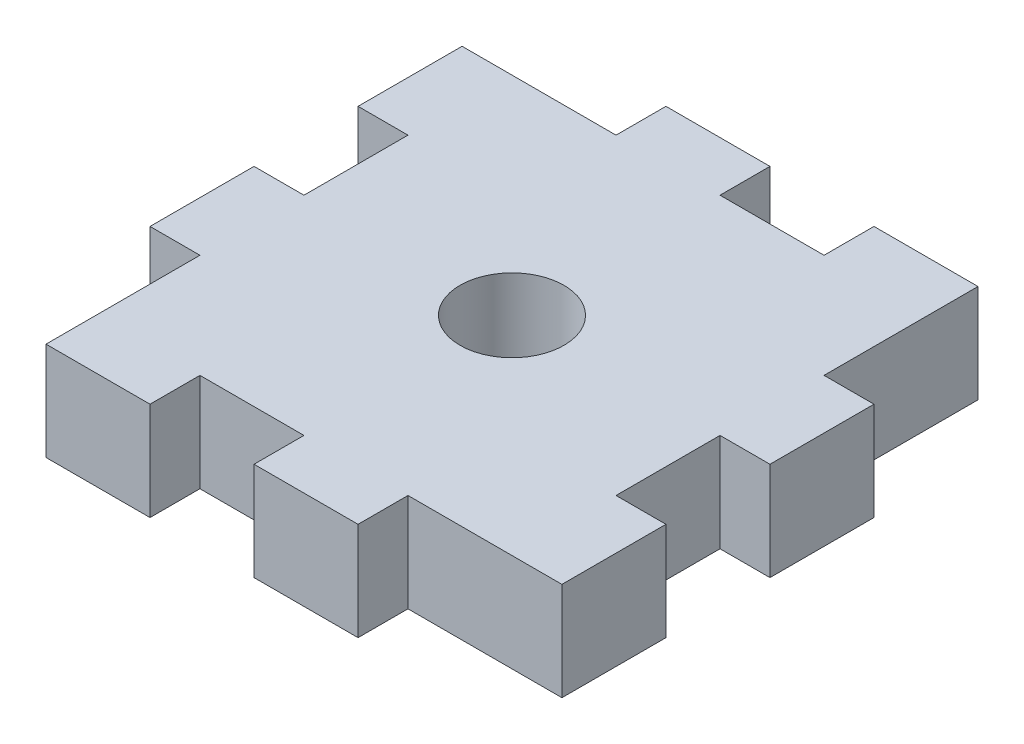
ISO-10303-21;
HEADER;
FILE_DESCRIPTION(('STEP AP214'),'2;1');
FILE_NAME('part.step','',(''),(''),'','','');
FILE_SCHEMA(('AUTOMOTIVE_DESIGN { 1 0 10303 214 1 1 1 1 }'));
ENDSEC;
DATA;
#1=APPLICATION_CONTEXT('core data for automotive mechanical design processes');
#2=APPLICATION_PROTOCOL_DEFINITION('international standard','automotive_design',2000,#1);
#3=PRODUCT_CONTEXT('',#1,'mechanical');
#4=PRODUCT('Part','Part','',(#3));
#5=PRODUCT_RELATED_PRODUCT_CATEGORY('part','',(#4));
#6=PRODUCT_DEFINITION_FORMATION('','',#4);
#7=PRODUCT_DEFINITION_CONTEXT('part definition',#1,'design');
#8=PRODUCT_DEFINITION('design','',#6,#7);
#9=PRODUCT_DEFINITION_SHAPE('','',#8);
#10=(LENGTH_UNIT() NAMED_UNIT(*) SI_UNIT(.MILLI.,.METRE.));
#11=(NAMED_UNIT(*) PLANE_ANGLE_UNIT() SI_UNIT($,.RADIAN.));
#12=(NAMED_UNIT(*) SI_UNIT($,.STERADIAN.) SOLID_ANGLE_UNIT());
#13=UNCERTAINTY_MEASURE_WITH_UNIT(LENGTH_MEASURE(1.E-05),#10,'distance_accuracy_value','');
#14=(GEOMETRIC_REPRESENTATION_CONTEXT(3) GLOBAL_UNCERTAINTY_ASSIGNED_CONTEXT((#13)) GLOBAL_UNIT_ASSIGNED_CONTEXT((#10,
#11,#12)) REPRESENTATION_CONTEXT('',''));
#15=CARTESIAN_POINT('',(0.,0.,0.));
#16=DIRECTION('',(0.,0.,1.));
#17=DIRECTION('',(1.,0.,0.));
#18=AXIS2_PLACEMENT_3D('',#15,#16,#17);
#19=CARTESIAN_POINT('',(0.,5.9944,0.));
#20=DIRECTION('',(0.,-1.,0.));
#21=DIRECTION('',(0.,0.,-1.));
#22=AXIS2_PLACEMENT_3D('',#19,#20,#21);
#23=PLANE('',#22);
#24=DIRECTION('',(0.,0.,-1.));
#25=VECTOR('',#24,1.);
#26=CARTESIAN_POINT('',(28.448,5.9944,-9.39799999999999));
#27=LINE('',#26,#25);
#28=CARTESIAN_POINT('',(28.448,5.9944,-3.04799999999999));
#29=VERTEX_POINT('',#28);
#30=CARTESIAN_POINT('',(28.448,5.9944,-9.39799999999999));
#31=VERTEX_POINT('',#30);
#32=EDGE_CURVE('E306',#29,#31,#27,.T.);
#33=ORIENTED_EDGE('',*,*,#32,.T.);
#34=DIRECTION('',(-1.,0.,0.));
#35=VECTOR('',#34,1.);
#36=CARTESIAN_POINT('',(25.4,5.9944,-9.39799999999999));
#37=LINE('',#36,#35);
#38=CARTESIAN_POINT('',(25.4,5.9944,-9.39799999999999));
#39=VERTEX_POINT('',#38);
#40=EDGE_CURVE('E154',#31,#39,#37,.T.);
#41=ORIENTED_EDGE('',*,*,#40,.T.);
#42=DIRECTION('',(0.,0.,-1.));
#43=VECTOR('',#42,1.);
#44=CARTESIAN_POINT('',(25.4,5.9944,-15.748));
#45=LINE('',#44,#43);
#46=CARTESIAN_POINT('',(25.4,5.9944,-15.748));
#47=VERTEX_POINT('',#46);
#48=EDGE_CURVE('E381',#39,#47,#45,.T.);
#49=ORIENTED_EDGE('',*,*,#48,.T.);
#50=DIRECTION('',(1.,0.,0.));
#51=VECTOR('',#50,1.);
#52=CARTESIAN_POINT('',(28.448,5.9944,-15.748));
#53=LINE('',#52,#51);
#54=CARTESIAN_POINT('',(28.448,5.9944,-15.748));
#55=VERTEX_POINT('',#54);
#56=EDGE_CURVE('E400',#47,#55,#53,.T.);
#57=ORIENTED_EDGE('',*,*,#56,.T.);
#58=DIRECTION('',(0.,0.,-1.));
#59=VECTOR('',#58,1.);
#60=CARTESIAN_POINT('',(28.448,5.9944,-22.098));
#61=LINE('',#60,#59);
#62=CARTESIAN_POINT('',(28.448,5.9944,-22.098));
#63=VERTEX_POINT('',#62);
#64=EDGE_CURVE('E397',#55,#63,#61,.T.);
#65=ORIENTED_EDGE('',*,*,#64,.T.);
#66=DIRECTION('',(-1.,0.,0.));
#67=VECTOR('',#66,1.);
#68=CARTESIAN_POINT('',(25.4,5.9944,-22.098));
#69=LINE('',#68,#67);
#70=CARTESIAN_POINT('',(25.4,5.9944,-22.098));
#71=VERTEX_POINT('',#70);
#72=EDGE_CURVE('E399',#63,#71,#69,.T.);
#73=ORIENTED_EDGE('',*,*,#72,.T.);
#74=DIRECTION('',(0.,0.,-1.));
#75=VECTOR('',#74,1.);
#76=CARTESIAN_POINT('',(25.4,5.9944,-31.496));
#77=LINE('',#76,#75);
#78=CARTESIAN_POINT('',(25.4,5.9944,-31.496));
#79=VERTEX_POINT('',#78);
#80=EDGE_CURVE('E402',#71,#79,#77,.T.);
#81=ORIENTED_EDGE('',*,*,#80,.T.);
#82=DIRECTION('',(-1.,0.,0.));
#83=VECTOR('',#82,1.);
#84=CARTESIAN_POINT('',(19.05,5.9944,-31.496));
#85=LINE('',#84,#83);
#86=CARTESIAN_POINT('',(19.05,5.9944,-31.496));
#87=VERTEX_POINT('',#86);
#88=EDGE_CURVE('E408',#79,#87,#85,.T.);
#89=ORIENTED_EDGE('',*,*,#88,.T.);
#90=DIRECTION('',(0.,0.,1.));
#91=VECTOR('',#90,1.);
#92=CARTESIAN_POINT('',(19.05,5.9944,-28.448));
#93=LINE('',#92,#91);
#94=CARTESIAN_POINT('',(19.05,5.9944,-28.448));
#95=VERTEX_POINT('',#94);
#96=EDGE_CURVE('E410',#87,#95,#93,.T.);
#97=ORIENTED_EDGE('',*,*,#96,.T.);
#98=DIRECTION('',(-1.,0.,0.));
#99=VECTOR('',#98,1.);
#100=CARTESIAN_POINT('',(12.7,5.9944,-28.448));
#101=LINE('',#100,#99);
#102=CARTESIAN_POINT('',(12.7,5.9944,-28.448));
#103=VERTEX_POINT('',#102);
#104=EDGE_CURVE('E412',#95,#103,#101,.T.);
#105=ORIENTED_EDGE('',*,*,#104,.T.);
#106=DIRECTION('',(0.,0.,-1.));
#107=VECTOR('',#106,1.);
#108=CARTESIAN_POINT('',(12.7,5.9944,-31.496));
#109=LINE('',#108,#107);
#110=CARTESIAN_POINT('',(12.7,5.9944,-31.496));
#111=VERTEX_POINT('',#110);
#112=EDGE_CURVE('E414',#103,#111,#109,.T.);
#113=ORIENTED_EDGE('',*,*,#112,.T.);
#114=DIRECTION('',(-1.,0.,0.));
#115=VECTOR('',#114,1.);
#116=CARTESIAN_POINT('',(6.35,5.9944,-31.496));
#117=LINE('',#116,#115);
#118=CARTESIAN_POINT('',(6.35,5.9944,-31.496));
#119=VERTEX_POINT('',#118);
#120=EDGE_CURVE('E416',#111,#119,#117,.T.);
#121=ORIENTED_EDGE('',*,*,#120,.T.);
#122=DIRECTION('',(0.,0.,1.));
#123=VECTOR('',#122,1.);
#124=CARTESIAN_POINT('',(6.34999999999999,5.9944,-28.448));
#125=LINE('',#124,#123);
#126=CARTESIAN_POINT('',(6.34999999999999,5.9944,-28.448));
#127=VERTEX_POINT('',#126);
#128=EDGE_CURVE('E418',#119,#127,#125,.T.);
#129=ORIENTED_EDGE('',*,*,#128,.T.);
#130=DIRECTION('',(-1.,0.,0.));
#131=VECTOR('',#130,1.);
#132=CARTESIAN_POINT('',(-3.04800000000001,5.9944,-28.448));
#133=LINE('',#132,#131);
#134=CARTESIAN_POINT('',(-3.04800000000001,5.9944,-28.448));
#135=VERTEX_POINT('',#134);
#136=EDGE_CURVE('E420',#127,#135,#133,.T.);
#137=ORIENTED_EDGE('',*,*,#136,.T.);
#138=DIRECTION('',(0.,0.,1.));
#139=VECTOR('',#138,1.);
#140=CARTESIAN_POINT('',(-3.04800000000001,5.9944,-22.098));
#141=LINE('',#140,#139);
#142=CARTESIAN_POINT('',(-3.04800000000001,5.9944,-22.098));
#143=VERTEX_POINT('',#142);
#144=EDGE_CURVE('E422',#135,#143,#141,.T.);
#145=ORIENTED_EDGE('',*,*,#144,.T.);
#146=DIRECTION('',(1.,0.,0.));
#147=VECTOR('',#146,1.);
#148=CARTESIAN_POINT('',(0.,5.9944,-22.098));
#149=LINE('',#148,#147);
#150=CARTESIAN_POINT('',(0.,5.9944,-22.098));
#151=VERTEX_POINT('',#150);
#152=EDGE_CURVE('E424',#143,#151,#149,.T.);
#153=ORIENTED_EDGE('',*,*,#152,.T.);
#154=DIRECTION('',(0.,0.,1.));
#155=VECTOR('',#154,1.);
#156=CARTESIAN_POINT('',(0.,5.9944,-15.748));
#157=LINE('',#156,#155);
#158=CARTESIAN_POINT('',(0.,5.9944,-15.748));
#159=VERTEX_POINT('',#158);
#160=EDGE_CURVE('E426',#151,#159,#157,.T.);
#161=ORIENTED_EDGE('',*,*,#160,.T.);
#162=DIRECTION('',(-1.,0.,0.));
#163=VECTOR('',#162,1.);
#164=CARTESIAN_POINT('',(-3.04800000000001,5.9944,-15.748));
#165=LINE('',#164,#163);
#166=CARTESIAN_POINT('',(-3.04800000000001,5.9944,-15.748));
#167=VERTEX_POINT('',#166);
#168=EDGE_CURVE('E428',#159,#167,#165,.T.);
#169=ORIENTED_EDGE('',*,*,#168,.T.);
#170=DIRECTION('',(0.,0.,1.));
#171=VECTOR('',#170,1.);
#172=CARTESIAN_POINT('',(-3.048,5.9944,-9.39799999999999));
#173=LINE('',#172,#171);
#174=CARTESIAN_POINT('',(-3.048,5.9944,-9.39799999999999));
#175=VERTEX_POINT('',#174);
#176=EDGE_CURVE('E430',#167,#175,#173,.T.);
#177=ORIENTED_EDGE('',*,*,#176,.T.);
#178=DIRECTION('',(1.,0.,0.));
#179=VECTOR('',#178,1.);
#180=CARTESIAN_POINT('',(0.,5.9944,-9.39799999999998));
#181=LINE('',#180,#179);
#182=CARTESIAN_POINT('',(0.,5.9944,-9.39799999999998));
#183=VERTEX_POINT('',#182);
#184=EDGE_CURVE('E432',#175,#183,#181,.T.);
#185=ORIENTED_EDGE('',*,*,#184,.T.);
#186=DIRECTION('',(0.,0.,1.));
#187=VECTOR('',#186,1.);
#188=CARTESIAN_POINT('',(0.,5.9944,0.));
#189=LINE('',#188,#187);
#190=CARTESIAN_POINT('',(0.,5.9944,0.));
#191=VERTEX_POINT('',#190);
#192=EDGE_CURVE('E434',#183,#191,#189,.T.);
#193=ORIENTED_EDGE('',*,*,#192,.T.);
#194=DIRECTION('',(1.,0.,0.));
#195=VECTOR('',#194,1.);
#196=CARTESIAN_POINT('',(6.35,5.9944,0.));
#197=LINE('',#196,#195);
#198=CARTESIAN_POINT('',(6.35,5.9944,0.));
#199=VERTEX_POINT('',#198);
#200=EDGE_CURVE('E436',#191,#199,#197,.T.);
#201=ORIENTED_EDGE('',*,*,#200,.T.);
#202=DIRECTION('',(0.,0.,-1.));
#203=VECTOR('',#202,1.);
#204=CARTESIAN_POINT('',(6.34999999999997,5.9944,-3.04799999999999));
#205=LINE('',#204,#203);
#206=CARTESIAN_POINT('',(6.34999999999997,5.9944,-3.04799999999999));
#207=VERTEX_POINT('',#206);
#208=EDGE_CURVE('E438',#199,#207,#205,.T.);
#209=ORIENTED_EDGE('',*,*,#208,.T.);
#210=DIRECTION('',(1.,0.,0.));
#211=VECTOR('',#210,1.);
#212=CARTESIAN_POINT('',(12.7,5.9944,-3.04799999999999));
#213=LINE('',#212,#211);
#214=CARTESIAN_POINT('',(12.7,5.9944,-3.04799999999999));
#215=VERTEX_POINT('',#214);
#216=EDGE_CURVE('E440',#207,#215,#213,.T.);
#217=ORIENTED_EDGE('',*,*,#216,.T.);
#218=DIRECTION('',(0.,0.,1.));
#219=VECTOR('',#218,1.);
#220=CARTESIAN_POINT('',(12.7,5.9944,0.));
#221=LINE('',#220,#219);
#222=CARTESIAN_POINT('',(12.7,5.9944,0.));
#223=VERTEX_POINT('',#222);
#224=EDGE_CURVE('E233',#215,#223,#221,.T.);
#225=ORIENTED_EDGE('',*,*,#224,.T.);
#226=DIRECTION('',(1.,0.,0.));
#227=VECTOR('',#226,1.);
#228=CARTESIAN_POINT('',(19.05,5.9944,0.));
#229=LINE('',#228,#227);
#230=CARTESIAN_POINT('',(19.05,5.9944,0.));
#231=VERTEX_POINT('',#230);
#232=EDGE_CURVE('E227',#223,#231,#229,.T.);
#233=ORIENTED_EDGE('',*,*,#232,.T.);
#234=DIRECTION('',(0.,0.,-1.));
#235=VECTOR('',#234,1.);
#236=CARTESIAN_POINT('',(19.05,5.9944,-3.04799999999999));
#237=LINE('',#236,#235);
#238=CARTESIAN_POINT('',(19.05,5.9944,-3.04799999999999));
#239=VERTEX_POINT('',#238);
#240=EDGE_CURVE('E231',#231,#239,#237,.T.);
#241=ORIENTED_EDGE('',*,*,#240,.T.);
#242=DIRECTION('',(1.,0.,0.));
#243=VECTOR('',#242,1.);
#244=CARTESIAN_POINT('',(28.448,5.9944,-3.04799999999999));
#245=LINE('',#244,#243);
#246=EDGE_CURVE('E51',#239,#29,#245,.T.);
#247=ORIENTED_EDGE('',*,*,#246,.T.);
#248=EDGE_LOOP('',(#33,#41,#49,#57,#65,#73,#81,#89,#97,#105,#113,#121,#129,#137,#145,#153,#161,
#169,#177,#185,#193,#201,#209,#217,#225,#233,#241,#247));
#249=FACE_BOUND('',#248,.T.);
#250=CARTESIAN_POINT('',(12.7,5.9944,-15.748));
#251=DIRECTION('',(0.,1.,0.));
#252=DIRECTION('',(0.,0.,1.));
#253=AXIS2_PLACEMENT_3D('',#250,#251,#252);
#254=CIRCLE('',#253,3.175);
#255=CARTESIAN_POINT('',(12.7,5.9944,-12.573));
#256=VERTEX_POINT('',#255);
#257=EDGE_CURVE('E255',#256,#256,#254,.T.);
#258=ORIENTED_EDGE('',*,*,#257,.F.);
#259=EDGE_LOOP('',(#258));
#260=FACE_BOUND('',#259,.T.);
#261=ADVANCED_FACE('F34',(#249,#260),#23,.F.);
#262=CARTESIAN_POINT('',(0.,0.,0.));
#263=DIRECTION('',(0.,-1.,0.));
#264=DIRECTION('',(0.,0.,-1.));
#265=AXIS2_PLACEMENT_3D('',#262,#263,#264);
#266=PLANE('',#265);
#267=DIRECTION('',(0.,0.,-1.));
#268=VECTOR('',#267,1.);
#269=CARTESIAN_POINT('',(28.448,0.,-9.39799999999999));
#270=LINE('',#269,#268);
#271=CARTESIAN_POINT('',(28.448,0.,-3.04799999999999));
#272=VERTEX_POINT('',#271);
#273=CARTESIAN_POINT('',(28.448,0.,-9.39799999999999));
#274=VERTEX_POINT('',#273);
#275=EDGE_CURVE('E251',#272,#274,#270,.T.);
#276=ORIENTED_EDGE('',*,*,#275,.F.);
#277=DIRECTION('',(1.,0.,0.));
#278=VECTOR('',#277,1.);
#279=CARTESIAN_POINT('',(28.448,0.,-3.04799999999999));
#280=LINE('',#279,#278);
#281=CARTESIAN_POINT('',(19.05,0.,-3.04799999999999));
#282=VERTEX_POINT('',#281);
#283=EDGE_CURVE('E146',#282,#272,#280,.T.);
#284=ORIENTED_EDGE('',*,*,#283,.F.);
#285=DIRECTION('',(0.,0.,-1.));
#286=VECTOR('',#285,1.);
#287=CARTESIAN_POINT('',(19.05,0.,-3.04799999999999));
#288=LINE('',#287,#286);
#289=CARTESIAN_POINT('',(19.05,0.,0.));
#290=VERTEX_POINT('',#289);
#291=EDGE_CURVE('E140',#290,#282,#288,.T.);
#292=ORIENTED_EDGE('',*,*,#291,.F.);
#293=DIRECTION('',(1.,0.,0.));
#294=VECTOR('',#293,1.);
#295=CARTESIAN_POINT('',(19.05,0.,0.));
#296=LINE('',#295,#294);
#297=CARTESIAN_POINT('',(12.7,0.,0.));
#298=VERTEX_POINT('',#297);
#299=EDGE_CURVE('E241',#298,#290,#296,.T.);
#300=ORIENTED_EDGE('',*,*,#299,.F.);
#301=DIRECTION('',(0.,0.,1.));
#302=VECTOR('',#301,1.);
#303=CARTESIAN_POINT('',(12.7,0.,0.));
#304=LINE('',#303,#302);
#305=CARTESIAN_POINT('',(12.7,0.,-3.04799999999999));
#306=VERTEX_POINT('',#305);
#307=EDGE_CURVE('E301',#306,#298,#304,.T.);
#308=ORIENTED_EDGE('',*,*,#307,.F.);
#309=DIRECTION('',(1.,0.,0.));
#310=VECTOR('',#309,1.);
#311=CARTESIAN_POINT('',(12.7,0.,-3.04799999999999));
#312=LINE('',#311,#310);
#313=CARTESIAN_POINT('',(6.34999999999997,0.,-3.04799999999999));
#314=VERTEX_POINT('',#313);
#315=EDGE_CURVE('E299',#314,#306,#312,.T.);
#316=ORIENTED_EDGE('',*,*,#315,.F.);
#317=DIRECTION('',(0.,0.,-1.));
#318=VECTOR('',#317,1.);
#319=CARTESIAN_POINT('',(6.34999999999997,0.,-3.04799999999999));
#320=LINE('',#319,#318);
#321=CARTESIAN_POINT('',(6.35,0.,0.));
#322=VERTEX_POINT('',#321);
#323=EDGE_CURVE('E297',#322,#314,#320,.T.);
#324=ORIENTED_EDGE('',*,*,#323,.F.);
#325=DIRECTION('',(1.,0.,0.));
#326=VECTOR('',#325,1.);
#327=CARTESIAN_POINT('',(6.35,0.,0.));
#328=LINE('',#327,#326);
#329=CARTESIAN_POINT('',(0.,0.,0.));
#330=VERTEX_POINT('',#329);
#331=EDGE_CURVE('E295',#330,#322,#328,.T.);
#332=ORIENTED_EDGE('',*,*,#331,.F.);
#333=DIRECTION('',(0.,0.,1.));
#334=VECTOR('',#333,1.);
#335=CARTESIAN_POINT('',(0.,0.,0.));
#336=LINE('',#335,#334);
#337=CARTESIAN_POINT('',(0.,0.,-9.39799999999998));
#338=VERTEX_POINT('',#337);
#339=EDGE_CURVE('E293',#338,#330,#336,.T.);
#340=ORIENTED_EDGE('',*,*,#339,.F.);
#341=DIRECTION('',(1.,0.,0.));
#342=VECTOR('',#341,1.);
#343=CARTESIAN_POINT('',(0.,0.,-9.39799999999998));
#344=LINE('',#343,#342);
#345=CARTESIAN_POINT('',(-3.048,0.,-9.39799999999999));
#346=VERTEX_POINT('',#345);
#347=EDGE_CURVE('E291',#346,#338,#344,.T.);
#348=ORIENTED_EDGE('',*,*,#347,.F.);
#349=DIRECTION('',(0.,0.,1.));
#350=VECTOR('',#349,1.);
#351=CARTESIAN_POINT('',(-3.048,0.,-9.39799999999999));
#352=LINE('',#351,#350);
#353=CARTESIAN_POINT('',(-3.04800000000001,0.,-15.748));
#354=VERTEX_POINT('',#353);
#355=EDGE_CURVE('E289',#354,#346,#352,.T.);
#356=ORIENTED_EDGE('',*,*,#355,.F.);
#357=DIRECTION('',(-1.,0.,0.));
#358=VECTOR('',#357,1.);
#359=CARTESIAN_POINT('',(-3.04800000000001,0.,-15.748));
#360=LINE('',#359,#358);
#361=CARTESIAN_POINT('',(0.,0.,-15.748));
#362=VERTEX_POINT('',#361);
#363=EDGE_CURVE('E287',#362,#354,#360,.T.);
#364=ORIENTED_EDGE('',*,*,#363,.F.);
#365=DIRECTION('',(0.,0.,1.));
#366=VECTOR('',#365,1.);
#367=CARTESIAN_POINT('',(0.,0.,-15.748));
#368=LINE('',#367,#366);
#369=CARTESIAN_POINT('',(0.,0.,-22.098));
#370=VERTEX_POINT('',#369);
#371=EDGE_CURVE('E285',#370,#362,#368,.T.);
#372=ORIENTED_EDGE('',*,*,#371,.F.);
#373=DIRECTION('',(1.,0.,0.));
#374=VECTOR('',#373,1.);
#375=CARTESIAN_POINT('',(0.,0.,-22.098));
#376=LINE('',#375,#374);
#377=CARTESIAN_POINT('',(-3.04800000000001,0.,-22.098));
#378=VERTEX_POINT('',#377);
#379=EDGE_CURVE('E283',#378,#370,#376,.T.);
#380=ORIENTED_EDGE('',*,*,#379,.F.);
#381=DIRECTION('',(0.,0.,1.));
#382=VECTOR('',#381,1.);
#383=CARTESIAN_POINT('',(-3.04800000000001,0.,-22.098));
#384=LINE('',#383,#382);
#385=CARTESIAN_POINT('',(-3.04800000000001,0.,-28.448));
#386=VERTEX_POINT('',#385);
#387=EDGE_CURVE('E281',#386,#378,#384,.T.);
#388=ORIENTED_EDGE('',*,*,#387,.F.);
#389=DIRECTION('',(-1.,0.,0.));
#390=VECTOR('',#389,1.);
#391=CARTESIAN_POINT('',(-3.04800000000001,0.,-28.448));
#392=LINE('',#391,#390);
#393=CARTESIAN_POINT('',(6.34999999999999,0.,-28.448));
#394=VERTEX_POINT('',#393);
#395=EDGE_CURVE('E279',#394,#386,#392,.T.);
#396=ORIENTED_EDGE('',*,*,#395,.F.);
#397=DIRECTION('',(0.,0.,1.));
#398=VECTOR('',#397,1.);
#399=CARTESIAN_POINT('',(6.34999999999999,0.,-28.448));
#400=LINE('',#399,#398);
#401=CARTESIAN_POINT('',(6.35,0.,-31.496));
#402=VERTEX_POINT('',#401);
#403=EDGE_CURVE('E277',#402,#394,#400,.T.);
#404=ORIENTED_EDGE('',*,*,#403,.F.);
#405=DIRECTION('',(-1.,0.,0.));
#406=VECTOR('',#405,1.);
#407=CARTESIAN_POINT('',(6.35,0.,-31.496));
#408=LINE('',#407,#406);
#409=CARTESIAN_POINT('',(12.7,0.,-31.496));
#410=VERTEX_POINT('',#409);
#411=EDGE_CURVE('E275',#410,#402,#408,.T.);
#412=ORIENTED_EDGE('',*,*,#411,.F.);
#413=DIRECTION('',(0.,0.,-1.));
#414=VECTOR('',#413,1.);
#415=CARTESIAN_POINT('',(12.7,0.,-31.496));
#416=LINE('',#415,#414);
#417=CARTESIAN_POINT('',(12.7,0.,-28.448));
#418=VERTEX_POINT('',#417);
#419=EDGE_CURVE('E273',#418,#410,#416,.T.);
#420=ORIENTED_EDGE('',*,*,#419,.F.);
#421=DIRECTION('',(-1.,0.,0.));
#422=VECTOR('',#421,1.);
#423=CARTESIAN_POINT('',(12.7,0.,-28.448));
#424=LINE('',#423,#422);
#425=CARTESIAN_POINT('',(19.05,0.,-28.448));
#426=VERTEX_POINT('',#425);
#427=EDGE_CURVE('E271',#426,#418,#424,.T.);
#428=ORIENTED_EDGE('',*,*,#427,.F.);
#429=DIRECTION('',(0.,0.,1.));
#430=VECTOR('',#429,1.);
#431=CARTESIAN_POINT('',(19.05,0.,-28.448));
#432=LINE('',#431,#430);
#433=CARTESIAN_POINT('',(19.05,0.,-31.496));
#434=VERTEX_POINT('',#433);
#435=EDGE_CURVE('E269',#434,#426,#432,.T.);
#436=ORIENTED_EDGE('',*,*,#435,.F.);
#437=DIRECTION('',(-1.,0.,0.));
#438=VECTOR('',#437,1.);
#439=CARTESIAN_POINT('',(19.05,0.,-31.496));
#440=LINE('',#439,#438);
#441=CARTESIAN_POINT('',(25.4,0.,-31.496));
#442=VERTEX_POINT('',#441);
#443=EDGE_CURVE('E267',#442,#434,#440,.T.);
#444=ORIENTED_EDGE('',*,*,#443,.F.);
#445=DIRECTION('',(0.,0.,-1.));
#446=VECTOR('',#445,1.);
#447=CARTESIAN_POINT('',(25.4,0.,-31.496));
#448=LINE('',#447,#446);
#449=CARTESIAN_POINT('',(25.4,0.,-22.098));
#450=VERTEX_POINT('',#449);
#451=EDGE_CURVE('E265',#450,#442,#448,.T.);
#452=ORIENTED_EDGE('',*,*,#451,.F.);
#453=DIRECTION('',(-1.,0.,0.));
#454=VECTOR('',#453,1.);
#455=CARTESIAN_POINT('',(25.4,0.,-22.098));
#456=LINE('',#455,#454);
#457=CARTESIAN_POINT('',(28.448,0.,-22.098));
#458=VERTEX_POINT('',#457);
#459=EDGE_CURVE('E263',#458,#450,#456,.T.);
#460=ORIENTED_EDGE('',*,*,#459,.F.);
#461=DIRECTION('',(0.,0.,-1.));
#462=VECTOR('',#461,1.);
#463=CARTESIAN_POINT('',(28.448,0.,-22.098));
#464=LINE('',#463,#462);
#465=CARTESIAN_POINT('',(28.448,0.,-15.748));
#466=VERTEX_POINT('',#465);
#467=EDGE_CURVE('E261',#466,#458,#464,.T.);
#468=ORIENTED_EDGE('',*,*,#467,.F.);
#469=DIRECTION('',(1.,0.,0.));
#470=VECTOR('',#469,1.);
#471=CARTESIAN_POINT('',(28.448,0.,-15.748));
#472=LINE('',#471,#470);
#473=CARTESIAN_POINT('',(25.4,0.,-15.748));
#474=VERTEX_POINT('',#473);
#475=EDGE_CURVE('E259',#474,#466,#472,.T.);
#476=ORIENTED_EDGE('',*,*,#475,.F.);
#477=DIRECTION('',(0.,0.,-1.));
#478=VECTOR('',#477,1.);
#479=CARTESIAN_POINT('',(25.4,0.,-15.748));
#480=LINE('',#479,#478);
#481=CARTESIAN_POINT('',(25.4,0.,-9.39799999999999));
#482=VERTEX_POINT('',#481);
#483=EDGE_CURVE('E257',#482,#474,#480,.T.);
#484=ORIENTED_EDGE('',*,*,#483,.F.);
#485=DIRECTION('',(-1.,0.,0.));
#486=VECTOR('',#485,1.);
#487=CARTESIAN_POINT('',(25.4,0.,-9.39799999999999));
#488=LINE('',#487,#486);
#489=EDGE_CURVE('E254',#274,#482,#488,.T.);
#490=ORIENTED_EDGE('',*,*,#489,.F.);
#491=EDGE_LOOP('',(#276,#284,#292,#300,#308,#316,#324,#332,#340,#348,#356,#364,#372,#380,#388,
#396,#404,#412,#420,#428,#436,#444,#452,#460,#468,#476,#484,#490));
#492=FACE_BOUND('',#491,.T.);
#493=CARTESIAN_POINT('',(12.7,0.,-15.748));
#494=DIRECTION('',(0.,1.,0.));
#495=DIRECTION('',(0.,0.,1.));
#496=AXIS2_PLACEMENT_3D('',#493,#494,#495);
#497=CIRCLE('',#496,3.175);
#498=CARTESIAN_POINT('',(12.7,0.,-12.573));
#499=VERTEX_POINT('',#498);
#500=EDGE_CURVE('E795',#499,#499,#497,.T.);
#501=ORIENTED_EDGE('',*,*,#500,.T.);
#502=EDGE_LOOP('',(#501));
#503=FACE_BOUND('',#502,.T.);
#504=ADVANCED_FACE('F385',(#492,#503),#266,.T.);
#505=CARTESIAN_POINT('',(28.448,5.9944,-9.39799999999999));
#506=DIRECTION('',(-1.,0.,0.));
#507=DIRECTION('',(0.,0.,1.));
#508=AXIS2_PLACEMENT_3D('',#505,#506,#507);
#509=PLANE('',#508);
#510=ORIENTED_EDGE('',*,*,#275,.T.);
#511=DIRECTION('',(0.,-1.,0.));
#512=VECTOR('',#511,1.);
#513=CARTESIAN_POINT('',(28.448,5.9944,-9.39799999999999));
#514=LINE('',#513,#512);
#515=EDGE_CURVE('E11',#31,#274,#514,.T.);
#516=ORIENTED_EDGE('',*,*,#515,.F.);
#517=ORIENTED_EDGE('',*,*,#32,.F.);
#518=DIRECTION('',(0.,-1.,0.));
#519=VECTOR('',#518,1.);
#520=CARTESIAN_POINT('',(28.448,5.9944,-3.04799999999999));
#521=LINE('',#520,#519);
#522=EDGE_CURVE('E247',#29,#272,#521,.T.);
#523=ORIENTED_EDGE('',*,*,#522,.T.);
#524=EDGE_LOOP('',(#510,#516,#517,#523));
#525=FACE_BOUND('',#524,.T.);
#526=ADVANCED_FACE('F36',(#525),#509,.F.);
#527=CARTESIAN_POINT('',(25.4,5.9944,-9.39799999999999));
#528=DIRECTION('',(0.,0.,1.));
#529=DIRECTION('',(1.,0.,0.));
#530=AXIS2_PLACEMENT_3D('',#527,#528,#529);
#531=PLANE('',#530);
#532=ORIENTED_EDGE('',*,*,#489,.T.);
#533=DIRECTION('',(0.,-1.,0.));
#534=VECTOR('',#533,1.);
#535=CARTESIAN_POINT('',(25.4,5.9944,-9.39799999999999));
#536=LINE('',#535,#534);
#537=EDGE_CURVE('E43',#39,#482,#536,.T.);
#538=ORIENTED_EDGE('',*,*,#537,.F.);
#539=ORIENTED_EDGE('',*,*,#40,.F.);
#540=ORIENTED_EDGE('',*,*,#515,.T.);
#541=EDGE_LOOP('',(#532,#538,#539,#540));
#542=FACE_BOUND('',#541,.T.);
#543=ADVANCED_FACE('F474',(#542),#531,.F.);
#544=CARTESIAN_POINT('',(25.4,5.9944,-15.748));
#545=DIRECTION('',(-1.,0.,0.));
#546=DIRECTION('',(0.,0.,1.));
#547=AXIS2_PLACEMENT_3D('',#544,#545,#546);
#548=PLANE('',#547);
#549=ORIENTED_EDGE('',*,*,#483,.T.);
#550=DIRECTION('',(0.,-1.,0.));
#551=VECTOR('',#550,1.);
#552=CARTESIAN_POINT('',(25.4,5.9944,-15.748));
#553=LINE('',#552,#551);
#554=EDGE_CURVE('E373',#47,#474,#553,.T.);
#555=ORIENTED_EDGE('',*,*,#554,.F.);
#556=ORIENTED_EDGE('',*,*,#48,.F.);
#557=ORIENTED_EDGE('',*,*,#537,.T.);
#558=EDGE_LOOP('',(#549,#555,#556,#557));
#559=FACE_BOUND('',#558,.T.);
#560=ADVANCED_FACE('F379',(#559),#548,.F.);
#561=CARTESIAN_POINT('',(28.448,5.9944,-15.748));
#562=DIRECTION('',(0.,0.,-1.));
#563=DIRECTION('',(-1.,0.,0.));
#564=AXIS2_PLACEMENT_3D('',#561,#562,#563);
#565=PLANE('',#564);
#566=ORIENTED_EDGE('',*,*,#475,.T.);
#567=DIRECTION('',(0.,-1.,0.));
#568=VECTOR('',#567,1.);
#569=CARTESIAN_POINT('',(28.448,5.9944,-15.748));
#570=LINE('',#569,#568);
#571=EDGE_CURVE('E370',#55,#466,#570,.T.);
#572=ORIENTED_EDGE('',*,*,#571,.F.);
#573=ORIENTED_EDGE('',*,*,#56,.F.);
#574=ORIENTED_EDGE('',*,*,#554,.T.);
#575=EDGE_LOOP('',(#566,#572,#573,#574));
#576=FACE_BOUND('',#575,.T.);
#577=ADVANCED_FACE('F391',(#576),#565,.F.);
#578=CARTESIAN_POINT('',(28.448,5.9944,-22.098));
#579=DIRECTION('',(-1.,0.,0.));
#580=DIRECTION('',(0.,0.,1.));
#581=AXIS2_PLACEMENT_3D('',#578,#579,#580);
#582=PLANE('',#581);
#583=ORIENTED_EDGE('',*,*,#467,.T.);
#584=DIRECTION('',(0.,-1.,0.));
#585=VECTOR('',#584,1.);
#586=CARTESIAN_POINT('',(28.448,5.9944,-22.098));
#587=LINE('',#586,#585);
#588=EDGE_CURVE('E367',#63,#458,#587,.T.);
#589=ORIENTED_EDGE('',*,*,#588,.F.);
#590=ORIENTED_EDGE('',*,*,#64,.F.);
#591=ORIENTED_EDGE('',*,*,#571,.T.);
#592=EDGE_LOOP('',(#583,#589,#590,#591));
#593=FACE_BOUND('',#592,.T.);
#594=ADVANCED_FACE('F395',(#593),#582,.F.);
#595=CARTESIAN_POINT('',(25.4,5.9944,-22.098));
#596=DIRECTION('',(0.,0.,1.));
#597=DIRECTION('',(1.,0.,0.));
#598=AXIS2_PLACEMENT_3D('',#595,#596,#597);
#599=PLANE('',#598);
#600=ORIENTED_EDGE('',*,*,#459,.T.);
#601=DIRECTION('',(0.,-1.,0.));
#602=VECTOR('',#601,1.);
#603=CARTESIAN_POINT('',(25.4,5.9944,-22.098));
#604=LINE('',#603,#602);
#605=EDGE_CURVE('E364',#71,#450,#604,.T.);
#606=ORIENTED_EDGE('',*,*,#605,.F.);
#607=ORIENTED_EDGE('',*,*,#72,.F.);
#608=ORIENTED_EDGE('',*,*,#588,.T.);
#609=EDGE_LOOP('',(#600,#606,#607,#608));
#610=FACE_BOUND('',#609,.T.);
#611=ADVANCED_FACE('F487',(#610),#599,.F.);
#612=CARTESIAN_POINT('',(25.4,5.9944,-31.496));
#613=DIRECTION('',(-1.,0.,0.));
#614=DIRECTION('',(0.,0.,1.));
#615=AXIS2_PLACEMENT_3D('',#612,#613,#614);
#616=PLANE('',#615);
#617=ORIENTED_EDGE('',*,*,#451,.T.);
#618=DIRECTION('',(0.,-1.,0.));
#619=VECTOR('',#618,1.);
#620=CARTESIAN_POINT('',(25.4,5.9944,-31.496));
#621=LINE('',#620,#619);
#622=EDGE_CURVE('E361',#79,#442,#621,.T.);
#623=ORIENTED_EDGE('',*,*,#622,.F.);
#624=ORIENTED_EDGE('',*,*,#80,.F.);
#625=ORIENTED_EDGE('',*,*,#605,.T.);
#626=EDGE_LOOP('',(#617,#623,#624,#625));
#627=FACE_BOUND('',#626,.T.);
#628=ADVANCED_FACE('F490',(#627),#616,.F.);
#629=CARTESIAN_POINT('',(19.05,5.9944,-31.496));
#630=DIRECTION('',(0.,0.,1.));
#631=DIRECTION('',(1.,0.,0.));
#632=AXIS2_PLACEMENT_3D('',#629,#630,#631);
#633=PLANE('',#632);
#634=ORIENTED_EDGE('',*,*,#443,.T.);
#635=DIRECTION('',(0.,-1.,0.));
#636=VECTOR('',#635,1.);
#637=CARTESIAN_POINT('',(19.05,5.9944,-31.496));
#638=LINE('',#637,#636);
#639=EDGE_CURVE('E358',#87,#434,#638,.T.);
#640=ORIENTED_EDGE('',*,*,#639,.F.);
#641=ORIENTED_EDGE('',*,*,#88,.F.);
#642=ORIENTED_EDGE('',*,*,#622,.T.);
#643=EDGE_LOOP('',(#634,#640,#641,#642));
#644=FACE_BOUND('',#643,.T.);
#645=ADVANCED_FACE('F494',(#644),#633,.F.);
#646=CARTESIAN_POINT('',(19.05,5.9944,-28.448));
#647=DIRECTION('',(1.,0.,0.));
#648=DIRECTION('',(0.,0.,-1.));
#649=AXIS2_PLACEMENT_3D('',#646,#647,#648);
#650=PLANE('',#649);
#651=ORIENTED_EDGE('',*,*,#435,.T.);
#652=DIRECTION('',(0.,-1.,0.));
#653=VECTOR('',#652,1.);
#654=CARTESIAN_POINT('',(19.05,5.9944,-28.448));
#655=LINE('',#654,#653);
#656=EDGE_CURVE('E355',#95,#426,#655,.T.);
#657=ORIENTED_EDGE('',*,*,#656,.F.);
#658=ORIENTED_EDGE('',*,*,#96,.F.);
#659=ORIENTED_EDGE('',*,*,#639,.T.);
#660=EDGE_LOOP('',(#651,#657,#658,#659));
#661=FACE_BOUND('',#660,.T.);
#662=ADVANCED_FACE('F498',(#661),#650,.F.);
#663=CARTESIAN_POINT('',(12.7,5.9944,-28.448));
#664=DIRECTION('',(0.,0.,1.));
#665=DIRECTION('',(1.,0.,0.));
#666=AXIS2_PLACEMENT_3D('',#663,#664,#665);
#667=PLANE('',#666);
#668=ORIENTED_EDGE('',*,*,#427,.T.);
#669=DIRECTION('',(0.,-1.,0.));
#670=VECTOR('',#669,1.);
#671=CARTESIAN_POINT('',(12.7,5.9944,-28.448));
#672=LINE('',#671,#670);
#673=EDGE_CURVE('E352',#103,#418,#672,.T.);
#674=ORIENTED_EDGE('',*,*,#673,.F.);
#675=ORIENTED_EDGE('',*,*,#104,.F.);
#676=ORIENTED_EDGE('',*,*,#656,.T.);
#677=EDGE_LOOP('',(#668,#674,#675,#676));
#678=FACE_BOUND('',#677,.T.);
#679=ADVANCED_FACE('F502',(#678),#667,.F.);
#680=CARTESIAN_POINT('',(12.7,5.9944,-31.496));
#681=DIRECTION('',(-1.,0.,0.));
#682=DIRECTION('',(0.,0.,1.));
#683=AXIS2_PLACEMENT_3D('',#680,#681,#682);
#684=PLANE('',#683);
#685=ORIENTED_EDGE('',*,*,#419,.T.);
#686=DIRECTION('',(0.,-1.,0.));
#687=VECTOR('',#686,1.);
#688=CARTESIAN_POINT('',(12.7,5.9944,-31.496));
#689=LINE('',#688,#687);
#690=EDGE_CURVE('E349',#111,#410,#689,.T.);
#691=ORIENTED_EDGE('',*,*,#690,.F.);
#692=ORIENTED_EDGE('',*,*,#112,.F.);
#693=ORIENTED_EDGE('',*,*,#673,.T.);
#694=EDGE_LOOP('',(#685,#691,#692,#693));
#695=FACE_BOUND('',#694,.T.);
#696=ADVANCED_FACE('F506',(#695),#684,.F.);
#697=CARTESIAN_POINT('',(6.35,5.9944,-31.496));
#698=DIRECTION('',(0.,0.,1.));
#699=DIRECTION('',(1.,0.,0.));
#700=AXIS2_PLACEMENT_3D('',#697,#698,#699);
#701=PLANE('',#700);
#702=ORIENTED_EDGE('',*,*,#411,.T.);
#703=DIRECTION('',(0.,-1.,0.));
#704=VECTOR('',#703,1.);
#705=CARTESIAN_POINT('',(6.35,5.9944,-31.496));
#706=LINE('',#705,#704);
#707=EDGE_CURVE('E346',#119,#402,#706,.T.);
#708=ORIENTED_EDGE('',*,*,#707,.F.);
#709=ORIENTED_EDGE('',*,*,#120,.F.);
#710=ORIENTED_EDGE('',*,*,#690,.T.);
#711=EDGE_LOOP('',(#702,#708,#709,#710));
#712=FACE_BOUND('',#711,.T.);
#713=ADVANCED_FACE('F510',(#712),#701,.F.);
#714=CARTESIAN_POINT('',(6.34999999999999,5.9944,-28.448));
#715=DIRECTION('',(1.,0.,0.));
#716=DIRECTION('',(0.,0.,-1.));
#717=AXIS2_PLACEMENT_3D('',#714,#715,#716);
#718=PLANE('',#717);
#719=ORIENTED_EDGE('',*,*,#403,.T.);
#720=DIRECTION('',(0.,-1.,0.));
#721=VECTOR('',#720,1.);
#722=CARTESIAN_POINT('',(6.34999999999999,5.9944,-28.448));
#723=LINE('',#722,#721);
#724=EDGE_CURVE('E343',#127,#394,#723,.T.);
#725=ORIENTED_EDGE('',*,*,#724,.F.);
#726=ORIENTED_EDGE('',*,*,#128,.F.);
#727=ORIENTED_EDGE('',*,*,#707,.T.);
#728=EDGE_LOOP('',(#719,#725,#726,#727));
#729=FACE_BOUND('',#728,.T.);
#730=ADVANCED_FACE('F514',(#729),#718,.F.);
#731=CARTESIAN_POINT('',(-3.04800000000001,5.9944,-28.448));
#732=DIRECTION('',(0.,0.,1.));
#733=DIRECTION('',(1.,0.,0.));
#734=AXIS2_PLACEMENT_3D('',#731,#732,#733);
#735=PLANE('',#734);
#736=ORIENTED_EDGE('',*,*,#395,.T.);
#737=DIRECTION('',(0.,-1.,0.));
#738=VECTOR('',#737,1.);
#739=CARTESIAN_POINT('',(-3.04800000000001,5.9944,-28.448));
#740=LINE('',#739,#738);
#741=EDGE_CURVE('E340',#135,#386,#740,.T.);
#742=ORIENTED_EDGE('',*,*,#741,.F.);
#743=ORIENTED_EDGE('',*,*,#136,.F.);
#744=ORIENTED_EDGE('',*,*,#724,.T.);
#745=EDGE_LOOP('',(#736,#742,#743,#744));
#746=FACE_BOUND('',#745,.T.);
#747=ADVANCED_FACE('F518',(#746),#735,.F.);
#748=CARTESIAN_POINT('',(-3.04800000000001,5.9944,-22.098));
#749=DIRECTION('',(1.,0.,0.));
#750=DIRECTION('',(0.,0.,-1.));
#751=AXIS2_PLACEMENT_3D('',#748,#749,#750);
#752=PLANE('',#751);
#753=ORIENTED_EDGE('',*,*,#387,.T.);
#754=DIRECTION('',(0.,-1.,0.));
#755=VECTOR('',#754,1.);
#756=CARTESIAN_POINT('',(-3.04800000000001,5.9944,-22.098));
#757=LINE('',#756,#755);
#758=EDGE_CURVE('E337',#143,#378,#757,.T.);
#759=ORIENTED_EDGE('',*,*,#758,.F.);
#760=ORIENTED_EDGE('',*,*,#144,.F.);
#761=ORIENTED_EDGE('',*,*,#741,.T.);
#762=EDGE_LOOP('',(#753,#759,#760,#761));
#763=FACE_BOUND('',#762,.T.);
#764=ADVANCED_FACE('F522',(#763),#752,.F.);
#765=CARTESIAN_POINT('',(0.,5.9944,-22.098));
#766=DIRECTION('',(0.,0.,-1.));
#767=DIRECTION('',(-1.,0.,0.));
#768=AXIS2_PLACEMENT_3D('',#765,#766,#767);
#769=PLANE('',#768);
#770=ORIENTED_EDGE('',*,*,#379,.T.);
#771=DIRECTION('',(0.,-1.,0.));
#772=VECTOR('',#771,1.);
#773=CARTESIAN_POINT('',(0.,5.9944,-22.098));
#774=LINE('',#773,#772);
#775=EDGE_CURVE('E334',#151,#370,#774,.T.);
#776=ORIENTED_EDGE('',*,*,#775,.F.);
#777=ORIENTED_EDGE('',*,*,#152,.F.);
#778=ORIENTED_EDGE('',*,*,#758,.T.);
#779=EDGE_LOOP('',(#770,#776,#777,#778));
#780=FACE_BOUND('',#779,.T.);
#781=ADVANCED_FACE('F526',(#780),#769,.F.);
#782=CARTESIAN_POINT('',(0.,5.9944,-15.748));
#783=DIRECTION('',(1.,0.,0.));
#784=DIRECTION('',(0.,0.,-1.));
#785=AXIS2_PLACEMENT_3D('',#782,#783,#784);
#786=PLANE('',#785);
#787=ORIENTED_EDGE('',*,*,#371,.T.);
#788=DIRECTION('',(0.,-1.,0.));
#789=VECTOR('',#788,1.);
#790=CARTESIAN_POINT('',(0.,5.9944,-15.748));
#791=LINE('',#790,#789);
#792=EDGE_CURVE('E331',#159,#362,#791,.T.);
#793=ORIENTED_EDGE('',*,*,#792,.F.);
#794=ORIENTED_EDGE('',*,*,#160,.F.);
#795=ORIENTED_EDGE('',*,*,#775,.T.);
#796=EDGE_LOOP('',(#787,#793,#794,#795));
#797=FACE_BOUND('',#796,.T.);
#798=ADVANCED_FACE('F530',(#797),#786,.F.);
#799=CARTESIAN_POINT('',(-3.04800000000001,5.9944,-15.748));
#800=DIRECTION('',(0.,0.,1.));
#801=DIRECTION('',(1.,0.,0.));
#802=AXIS2_PLACEMENT_3D('',#799,#800,#801);
#803=PLANE('',#802);
#804=ORIENTED_EDGE('',*,*,#363,.T.);
#805=DIRECTION('',(0.,-1.,0.));
#806=VECTOR('',#805,1.);
#807=CARTESIAN_POINT('',(-3.04800000000001,5.9944,-15.748));
#808=LINE('',#807,#806);
#809=EDGE_CURVE('E328',#167,#354,#808,.T.);
#810=ORIENTED_EDGE('',*,*,#809,.F.);
#811=ORIENTED_EDGE('',*,*,#168,.F.);
#812=ORIENTED_EDGE('',*,*,#792,.T.);
#813=EDGE_LOOP('',(#804,#810,#811,#812));
#814=FACE_BOUND('',#813,.T.);
#815=ADVANCED_FACE('F534',(#814),#803,.F.);
#816=CARTESIAN_POINT('',(-3.048,5.9944,-9.39799999999999));
#817=DIRECTION('',(1.,0.,0.));
#818=DIRECTION('',(0.,0.,-1.));
#819=AXIS2_PLACEMENT_3D('',#816,#817,#818);
#820=PLANE('',#819);
#821=ORIENTED_EDGE('',*,*,#355,.T.);
#822=DIRECTION('',(0.,-1.,0.));
#823=VECTOR('',#822,1.);
#824=CARTESIAN_POINT('',(-3.048,5.9944,-9.39799999999999));
#825=LINE('',#824,#823);
#826=EDGE_CURVE('E325',#175,#346,#825,.T.);
#827=ORIENTED_EDGE('',*,*,#826,.F.);
#828=ORIENTED_EDGE('',*,*,#176,.F.);
#829=ORIENTED_EDGE('',*,*,#809,.T.);
#830=EDGE_LOOP('',(#821,#827,#828,#829));
#831=FACE_BOUND('',#830,.T.);
#832=ADVANCED_FACE('F538',(#831),#820,.F.);
#833=CARTESIAN_POINT('',(0.,5.9944,-9.39799999999998));
#834=DIRECTION('',(0.,0.,-1.));
#835=DIRECTION('',(-1.,0.,0.));
#836=AXIS2_PLACEMENT_3D('',#833,#834,#835);
#837=PLANE('',#836);
#838=ORIENTED_EDGE('',*,*,#347,.T.);
#839=DIRECTION('',(0.,-1.,0.));
#840=VECTOR('',#839,1.);
#841=CARTESIAN_POINT('',(0.,5.9944,-9.39799999999998));
#842=LINE('',#841,#840);
#843=EDGE_CURVE('E322',#183,#338,#842,.T.);
#844=ORIENTED_EDGE('',*,*,#843,.F.);
#845=ORIENTED_EDGE('',*,*,#184,.F.);
#846=ORIENTED_EDGE('',*,*,#826,.T.);
#847=EDGE_LOOP('',(#838,#844,#845,#846));
#848=FACE_BOUND('',#847,.T.);
#849=ADVANCED_FACE('F542',(#848),#837,.F.);
#850=CARTESIAN_POINT('',(0.,5.9944,0.));
#851=DIRECTION('',(1.,0.,0.));
#852=DIRECTION('',(0.,0.,-1.));
#853=AXIS2_PLACEMENT_3D('',#850,#851,#852);
#854=PLANE('',#853);
#855=ORIENTED_EDGE('',*,*,#339,.T.);
#856=DIRECTION('',(0.,-1.,0.));
#857=VECTOR('',#856,1.);
#858=CARTESIAN_POINT('',(0.,5.9944,0.));
#859=LINE('',#858,#857);
#860=EDGE_CURVE('E319',#191,#330,#859,.T.);
#861=ORIENTED_EDGE('',*,*,#860,.F.);
#862=ORIENTED_EDGE('',*,*,#192,.F.);
#863=ORIENTED_EDGE('',*,*,#843,.T.);
#864=EDGE_LOOP('',(#855,#861,#862,#863));
#865=FACE_BOUND('',#864,.T.);
#866=ADVANCED_FACE('F546',(#865),#854,.F.);
#867=CARTESIAN_POINT('',(6.35,5.9944,0.));
#868=DIRECTION('',(0.,0.,-1.));
#869=DIRECTION('',(-1.,0.,0.));
#870=AXIS2_PLACEMENT_3D('',#867,#868,#869);
#871=PLANE('',#870);
#872=ORIENTED_EDGE('',*,*,#331,.T.);
#873=DIRECTION('',(0.,-1.,0.));
#874=VECTOR('',#873,1.);
#875=CARTESIAN_POINT('',(6.35,5.9944,0.));
#876=LINE('',#875,#874);
#877=EDGE_CURVE('E316',#199,#322,#876,.T.);
#878=ORIENTED_EDGE('',*,*,#877,.F.);
#879=ORIENTED_EDGE('',*,*,#200,.F.);
#880=ORIENTED_EDGE('',*,*,#860,.T.);
#881=EDGE_LOOP('',(#872,#878,#879,#880));
#882=FACE_BOUND('',#881,.T.);
#883=ADVANCED_FACE('F550',(#882),#871,.F.);
#884=CARTESIAN_POINT('',(6.34999999999997,5.9944,-3.04799999999999));
#885=DIRECTION('',(-1.,0.,0.));
#886=DIRECTION('',(0.,0.,1.));
#887=AXIS2_PLACEMENT_3D('',#884,#885,#886);
#888=PLANE('',#887);
#889=ORIENTED_EDGE('',*,*,#323,.T.);
#890=DIRECTION('',(0.,-1.,0.));
#891=VECTOR('',#890,1.);
#892=CARTESIAN_POINT('',(6.34999999999997,5.9944,-3.04799999999999));
#893=LINE('',#892,#891);
#894=EDGE_CURVE('E313',#207,#314,#893,.T.);
#895=ORIENTED_EDGE('',*,*,#894,.F.);
#896=ORIENTED_EDGE('',*,*,#208,.F.);
#897=ORIENTED_EDGE('',*,*,#877,.T.);
#898=EDGE_LOOP('',(#889,#895,#896,#897));
#899=FACE_BOUND('',#898,.T.);
#900=ADVANCED_FACE('F554',(#899),#888,.F.);
#901=CARTESIAN_POINT('',(12.7,5.9944,-3.04799999999999));
#902=DIRECTION('',(0.,0.,-1.));
#903=DIRECTION('',(-1.,0.,0.));
#904=AXIS2_PLACEMENT_3D('',#901,#902,#903);
#905=PLANE('',#904);
#906=ORIENTED_EDGE('',*,*,#315,.T.);
#907=DIRECTION('',(0.,-1.,0.));
#908=VECTOR('',#907,1.);
#909=CARTESIAN_POINT('',(12.7,5.9944,-3.04799999999999));
#910=LINE('',#909,#908);
#911=EDGE_CURVE('E310',#215,#306,#910,.T.);
#912=ORIENTED_EDGE('',*,*,#911,.F.);
#913=ORIENTED_EDGE('',*,*,#216,.F.);
#914=ORIENTED_EDGE('',*,*,#894,.T.);
#915=EDGE_LOOP('',(#906,#912,#913,#914));
#916=FACE_BOUND('',#915,.T.);
#917=ADVANCED_FACE('F446',(#916),#905,.F.);
#918=CARTESIAN_POINT('',(12.7,5.9944,0.));
#919=DIRECTION('',(1.,0.,0.));
#920=DIRECTION('',(0.,0.,-1.));
#921=AXIS2_PLACEMENT_3D('',#918,#919,#920);
#922=PLANE('',#921);
#923=ORIENTED_EDGE('',*,*,#307,.T.);
#924=DIRECTION('',(0.,-1.,0.));
#925=VECTOR('',#924,1.);
#926=CARTESIAN_POINT('',(12.7,5.9944,0.));
#927=LINE('',#926,#925);
#928=EDGE_CURVE('E242',#223,#298,#927,.T.);
#929=ORIENTED_EDGE('',*,*,#928,.F.);
#930=ORIENTED_EDGE('',*,*,#224,.F.);
#931=ORIENTED_EDGE('',*,*,#911,.T.);
#932=EDGE_LOOP('',(#923,#929,#930,#931));
#933=FACE_BOUND('',#932,.T.);
#934=ADVANCED_FACE('F450',(#933),#922,.F.);
#935=CARTESIAN_POINT('',(19.05,5.9944,0.));
#936=DIRECTION('',(0.,0.,-1.));
#937=DIRECTION('',(-1.,0.,0.));
#938=AXIS2_PLACEMENT_3D('',#935,#936,#937);
#939=PLANE('',#938);
#940=ORIENTED_EDGE('',*,*,#299,.T.);
#941=DIRECTION('',(0.,-1.,0.));
#942=VECTOR('',#941,1.);
#943=CARTESIAN_POINT('',(19.05,5.9944,0.));
#944=LINE('',#943,#942);
#945=EDGE_CURVE('E238',#231,#290,#944,.T.);
#946=ORIENTED_EDGE('',*,*,#945,.F.);
#947=ORIENTED_EDGE('',*,*,#232,.F.);
#948=ORIENTED_EDGE('',*,*,#928,.T.);
#949=EDGE_LOOP('',(#940,#946,#947,#948));
#950=FACE_BOUND('',#949,.T.);
#951=ADVANCED_FACE('F239',(#950),#939,.F.);
#952=CARTESIAN_POINT('',(19.05,5.9944,-3.04799999999999));
#953=DIRECTION('',(-1.,0.,0.));
#954=DIRECTION('',(0.,0.,1.));
#955=AXIS2_PLACEMENT_3D('',#952,#953,#954);
#956=PLANE('',#955);
#957=ORIENTED_EDGE('',*,*,#291,.T.);
#958=DIRECTION('',(0.,-1.,0.));
#959=VECTOR('',#958,1.);
#960=CARTESIAN_POINT('',(19.05,5.9944,-3.04799999999999));
#961=LINE('',#960,#959);
#962=EDGE_CURVE('E243',#239,#282,#961,.T.);
#963=ORIENTED_EDGE('',*,*,#962,.F.);
#964=ORIENTED_EDGE('',*,*,#240,.F.);
#965=ORIENTED_EDGE('',*,*,#945,.T.);
#966=EDGE_LOOP('',(#957,#963,#964,#965));
#967=FACE_BOUND('',#966,.T.);
#968=ADVANCED_FACE('F245',(#967),#956,.F.);
#969=CARTESIAN_POINT('',(28.448,5.9944,-3.04799999999999));
#970=DIRECTION('',(0.,0.,-1.));
#971=DIRECTION('',(-1.,0.,0.));
#972=AXIS2_PLACEMENT_3D('',#969,#970,#971);
#973=PLANE('',#972);
#974=ORIENTED_EDGE('',*,*,#283,.T.);
#975=ORIENTED_EDGE('',*,*,#522,.F.);
#976=ORIENTED_EDGE('',*,*,#246,.F.);
#977=ORIENTED_EDGE('',*,*,#962,.T.);
#978=EDGE_LOOP('',(#974,#975,#976,#977));
#979=FACE_BOUND('',#978,.T.);
#980=ADVANCED_FACE('F454',(#979),#973,.F.);
#981=CARTESIAN_POINT('',(12.7,5.9944,-15.748));
#982=DIRECTION('',(0.,-1.,0.));
#983=DIRECTION('',(0.,0.,-1.));
#984=AXIS2_PLACEMENT_3D('',#981,#982,#983);
#985=CYLINDRICAL_SURFACE('',#984,3.175);
#986=ORIENTED_EDGE('',*,*,#257,.T.);
#987=EDGE_LOOP('',(#986));
#988=FACE_BOUND('',#987,.T.);
#989=ORIENTED_EDGE('',*,*,#500,.F.);
#990=EDGE_LOOP('',(#989));
#991=FACE_BOUND('',#990,.T.);
#992=ADVANCED_FACE('F456',(#988,#991),#985,.F.);
#993=CLOSED_SHELL('',(#261,#504,#526,#543,#560,#577,#594,#611,#628,#645,#662,#679,#696,#713,
#730,#747,#764,#781,#798,#815,#832,#849,#866,#883,#900,#917,#934,#951,#968,#980,#992));
#994=MANIFOLD_SOLID_BREP('B2',#993);
#995=ADVANCED_BREP_SHAPE_REPRESENTATION('',(#18,#994),#14);
#996=SHAPE_DEFINITION_REPRESENTATION(#9,#995);
ENDSEC;
END-ISO-10303-21;
